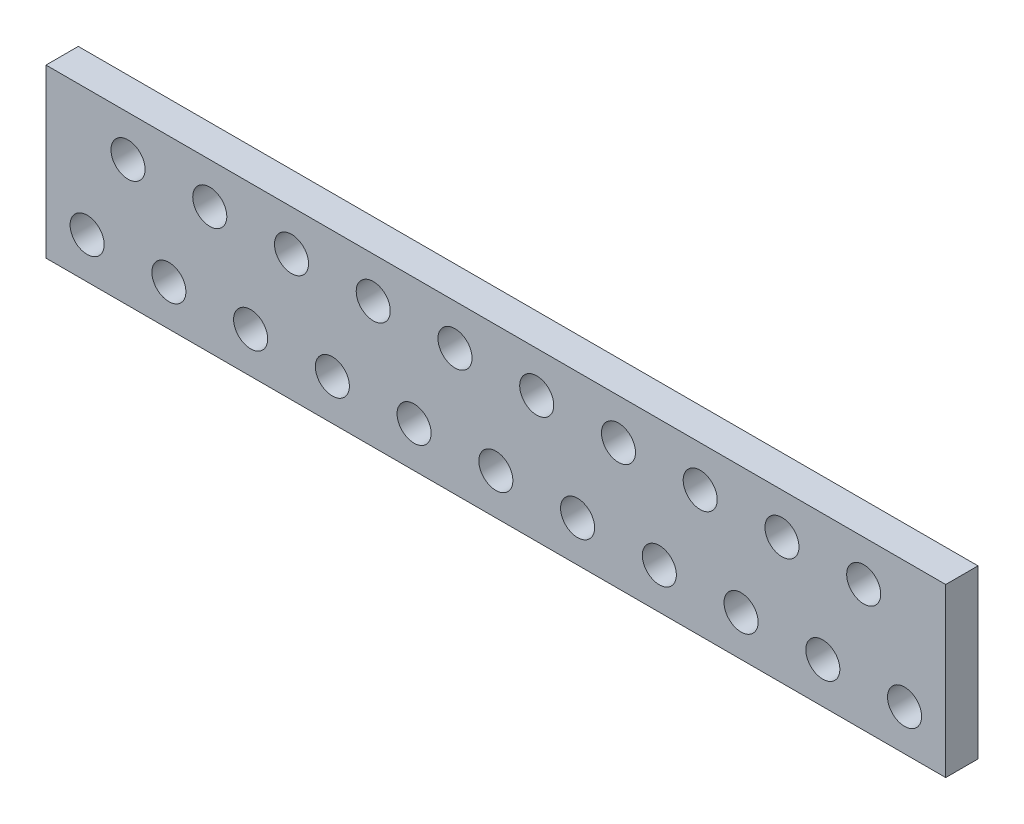
ISO-10303-21;
HEADER;
FILE_DESCRIPTION(('STEP AP214'),'2;1');
FILE_NAME('part.step','',(''),(''),'','','');
FILE_SCHEMA(('AUTOMOTIVE_DESIGN { 1 0 10303 214 1 1 1 1 }'));
ENDSEC;
DATA;
#1=APPLICATION_CONTEXT('core data for automotive mechanical design processes');
#2=APPLICATION_PROTOCOL_DEFINITION('international standard','automotive_design',2000,#1);
#3=PRODUCT_CONTEXT('',#1,'mechanical');
#4=PRODUCT('Part','Part','',(#3));
#5=PRODUCT_RELATED_PRODUCT_CATEGORY('part','',(#4));
#6=PRODUCT_DEFINITION_FORMATION('','',#4);
#7=PRODUCT_DEFINITION_CONTEXT('part definition',#1,'design');
#8=PRODUCT_DEFINITION('design','',#6,#7);
#9=PRODUCT_DEFINITION_SHAPE('','',#8);
#10=(LENGTH_UNIT() NAMED_UNIT(*) SI_UNIT(.MILLI.,.METRE.));
#11=(NAMED_UNIT(*) PLANE_ANGLE_UNIT() SI_UNIT($,.RADIAN.));
#12=(NAMED_UNIT(*) SI_UNIT($,.STERADIAN.) SOLID_ANGLE_UNIT());
#13=UNCERTAINTY_MEASURE_WITH_UNIT(LENGTH_MEASURE(1.E-05),#10,'distance_accuracy_value','');
#14=(GEOMETRIC_REPRESENTATION_CONTEXT(3) GLOBAL_UNCERTAINTY_ASSIGNED_CONTEXT((#13)) GLOBAL_UNIT_ASSIGNED_CONTEXT((#10,
#11,#12)) REPRESENTATION_CONTEXT('',''));
#15=CARTESIAN_POINT('',(0.,0.,0.));
#16=DIRECTION('',(0.,0.,1.));
#17=DIRECTION('',(1.,0.,0.));
#18=AXIS2_PLACEMENT_3D('',#15,#16,#17);
#19=CARTESIAN_POINT('',(-19.812,3.683,1.4224));
#20=DIRECTION('',(1.,0.,0.));
#21=DIRECTION('',(0.,0.,-1.));
#22=AXIS2_PLACEMENT_3D('',#19,#20,#21);
#23=PLANE('',#22);
#24=DIRECTION('',(0.,-1.,0.));
#25=VECTOR('',#24,1.);
#26=CARTESIAN_POINT('',(-19.812,3.683,0.));
#27=LINE('',#26,#25);
#28=CARTESIAN_POINT('',(-19.812,3.683,0.));
#29=VERTEX_POINT('',#28);
#30=CARTESIAN_POINT('',(-19.812,-3.683,0.));
#31=VERTEX_POINT('',#30);
#32=EDGE_CURVE('E95',#29,#31,#27,.T.);
#33=ORIENTED_EDGE('',*,*,#32,.T.);
#34=DIRECTION('',(0.,0.,-1.));
#35=VECTOR('',#34,1.);
#36=CARTESIAN_POINT('',(-19.812,-3.683,1.4224));
#37=LINE('',#36,#35);
#38=CARTESIAN_POINT('',(-19.812,-3.683,1.4224));
#39=VERTEX_POINT('',#38);
#40=EDGE_CURVE('E11',#39,#31,#37,.T.);
#41=ORIENTED_EDGE('',*,*,#40,.F.);
#42=DIRECTION('',(0.,-1.,0.));
#43=VECTOR('',#42,1.);
#44=CARTESIAN_POINT('',(-19.812,3.683,1.4224));
#45=LINE('',#44,#43);
#46=CARTESIAN_POINT('',(-19.812,3.683,1.4224));
#47=VERTEX_POINT('',#46);
#48=EDGE_CURVE('E81',#47,#39,#45,.T.);
#49=ORIENTED_EDGE('',*,*,#48,.F.);
#50=DIRECTION('',(0.,0.,-1.));
#51=VECTOR('',#50,1.);
#52=CARTESIAN_POINT('',(-19.812,3.683,1.4224));
#53=LINE('',#52,#51);
#54=EDGE_CURVE('E48',#47,#29,#53,.T.);
#55=ORIENTED_EDGE('',*,*,#54,.T.);
#56=EDGE_LOOP('',(#33,#41,#49,#55));
#57=FACE_BOUND('',#56,.T.);
#58=ADVANCED_FACE('F32',(#57),#23,.F.);
#59=CARTESIAN_POINT('',(-19.812,-3.683,1.4224));
#60=DIRECTION('',(0.,1.,0.));
#61=DIRECTION('',(0.,0.,1.));
#62=AXIS2_PLACEMENT_3D('',#59,#60,#61);
#63=PLANE('',#62);
#64=DIRECTION('',(1.,0.,0.));
#65=VECTOR('',#64,1.);
#66=CARTESIAN_POINT('',(-19.812,-3.683,0.));
#67=LINE('',#66,#65);
#68=CARTESIAN_POINT('',(19.812,-3.683,0.));
#69=VERTEX_POINT('',#68);
#70=EDGE_CURVE('E86',#31,#69,#67,.T.);
#71=ORIENTED_EDGE('',*,*,#70,.T.);
#72=DIRECTION('',(0.,0.,-1.));
#73=VECTOR('',#72,1.);
#74=CARTESIAN_POINT('',(19.812,-3.683,1.4224));
#75=LINE('',#74,#73);
#76=CARTESIAN_POINT('',(19.812,-3.683,1.4224));
#77=VERTEX_POINT('',#76);
#78=EDGE_CURVE('E40',#77,#69,#75,.T.);
#79=ORIENTED_EDGE('',*,*,#78,.F.);
#80=DIRECTION('',(1.,0.,0.));
#81=VECTOR('',#80,1.);
#82=CARTESIAN_POINT('',(-19.812,-3.683,1.4224));
#83=LINE('',#82,#81);
#84=EDGE_CURVE('E73',#39,#77,#83,.T.);
#85=ORIENTED_EDGE('',*,*,#84,.F.);
#86=ORIENTED_EDGE('',*,*,#40,.T.);
#87=EDGE_LOOP('',(#71,#79,#85,#86));
#88=FACE_BOUND('',#87,.T.);
#89=ADVANCED_FACE('F85',(#88),#63,.F.);
#90=CARTESIAN_POINT('',(19.812,3.683,1.4224));
#91=DIRECTION('',(1.,0.,0.));
#92=DIRECTION('',(0.,0.,-1.));
#93=AXIS2_PLACEMENT_3D('',#90,#91,#92);
#94=PLANE('',#93);
#95=DIRECTION('',(0.,-1.,0.));
#96=VECTOR('',#95,1.);
#97=CARTESIAN_POINT('',(19.812,3.683,0.));
#98=LINE('',#97,#96);
#99=CARTESIAN_POINT('',(19.812,3.683,0.));
#100=VERTEX_POINT('',#99);
#101=EDGE_CURVE('E99',#100,#69,#98,.T.);
#102=ORIENTED_EDGE('',*,*,#101,.F.);
#103=DIRECTION('',(0.,0.,-1.));
#104=VECTOR('',#103,1.);
#105=CARTESIAN_POINT('',(19.812,3.683,1.4224));
#106=LINE('',#105,#104);
#107=CARTESIAN_POINT('',(19.812,3.683,1.4224));
#108=VERTEX_POINT('',#107);
#109=EDGE_CURVE('E62',#108,#100,#106,.T.);
#110=ORIENTED_EDGE('',*,*,#109,.F.);
#111=DIRECTION('',(0.,-1.,0.));
#112=VECTOR('',#111,1.);
#113=CARTESIAN_POINT('',(19.812,3.683,1.4224));
#114=LINE('',#113,#112);
#115=EDGE_CURVE('E80',#108,#77,#114,.T.);
#116=ORIENTED_EDGE('',*,*,#115,.T.);
#117=ORIENTED_EDGE('',*,*,#78,.T.);
#118=EDGE_LOOP('',(#102,#110,#116,#117));
#119=FACE_BOUND('',#118,.T.);
#120=ADVANCED_FACE('F89',(#119),#94,.T.);
#121=CARTESIAN_POINT('',(-19.812,3.683,1.4224));
#122=DIRECTION('',(0.,1.,0.));
#123=DIRECTION('',(0.,0.,1.));
#124=AXIS2_PLACEMENT_3D('',#121,#122,#123);
#125=PLANE('',#124);
#126=DIRECTION('',(1.,0.,0.));
#127=VECTOR('',#126,1.);
#128=CARTESIAN_POINT('',(-19.812,3.683,0.));
#129=LINE('',#128,#127);
#130=EDGE_CURVE('E101',#29,#100,#129,.T.);
#131=ORIENTED_EDGE('',*,*,#130,.F.);
#132=ORIENTED_EDGE('',*,*,#54,.F.);
#133=DIRECTION('',(1.,0.,0.));
#134=VECTOR('',#133,1.);
#135=CARTESIAN_POINT('',(-19.812,3.683,1.4224));
#136=LINE('',#135,#134);
#137=EDGE_CURVE('E90',#47,#108,#136,.T.);
#138=ORIENTED_EDGE('',*,*,#137,.T.);
#139=ORIENTED_EDGE('',*,*,#109,.T.);
#140=EDGE_LOOP('',(#131,#132,#138,#139));
#141=FACE_BOUND('',#140,.T.);
#142=ADVANCED_FACE('F286',(#141),#125,.T.);
#143=CARTESIAN_POINT('',(0.,0.,1.4224));
#144=DIRECTION('',(0.,0.,1.));
#145=DIRECTION('',(1.,0.,0.));
#146=AXIS2_PLACEMENT_3D('',#143,#144,#145);
#147=PLANE('',#146);
#148=CARTESIAN_POINT('',(16.2,1.885,1.4224));
#149=DIRECTION('',(0.,0.,-1.));
#150=DIRECTION('',(-1.,0.,0.));
#151=AXIS2_PLACEMENT_3D('',#148,#149,#150);
#152=CIRCLE('',#151,0.75);
#153=CARTESIAN_POINT('',(15.45,1.885,1.4224));
#154=VERTEX_POINT('',#153);
#155=EDGE_CURVE('E224',#154,#154,#152,.T.);
#156=ORIENTED_EDGE('',*,*,#155,.T.);
#157=EDGE_LOOP('',(#156));
#158=FACE_BOUND('',#157,.T.);
#159=CARTESIAN_POINT('',(12.6,1.885,1.4224));
#160=DIRECTION('',(0.,0.,-1.));
#161=DIRECTION('',(-1.,0.,0.));
#162=AXIS2_PLACEMENT_3D('',#159,#160,#161);
#163=CIRCLE('',#162,0.75);
#164=CARTESIAN_POINT('',(11.85,1.885,1.4224));
#165=VERTEX_POINT('',#164);
#166=EDGE_CURVE('E218',#165,#165,#163,.T.);
#167=ORIENTED_EDGE('',*,*,#166,.T.);
#168=EDGE_LOOP('',(#167));
#169=FACE_BOUND('',#168,.T.);
#170=CARTESIAN_POINT('',(9.,1.885,1.4224));
#171=DIRECTION('',(0.,0.,-1.));
#172=DIRECTION('',(-1.,0.,0.));
#173=AXIS2_PLACEMENT_3D('',#170,#171,#172);
#174=CIRCLE('',#173,0.75);
#175=CARTESIAN_POINT('',(8.25,1.885,1.4224));
#176=VERTEX_POINT('',#175);
#177=EDGE_CURVE('E212',#176,#176,#174,.T.);
#178=ORIENTED_EDGE('',*,*,#177,.T.);
#179=EDGE_LOOP('',(#178));
#180=FACE_BOUND('',#179,.T.);
#181=CARTESIAN_POINT('',(5.4,1.885,1.4224));
#182=DIRECTION('',(0.,0.,-1.));
#183=DIRECTION('',(-1.,0.,0.));
#184=AXIS2_PLACEMENT_3D('',#181,#182,#183);
#185=CIRCLE('',#184,0.75);
#186=CARTESIAN_POINT('',(4.65,1.885,1.4224));
#187=VERTEX_POINT('',#186);
#188=EDGE_CURVE('E206',#187,#187,#185,.T.);
#189=ORIENTED_EDGE('',*,*,#188,.T.);
#190=EDGE_LOOP('',(#189));
#191=FACE_BOUND('',#190,.T.);
#192=CARTESIAN_POINT('',(1.8,1.885,1.4224));
#193=DIRECTION('',(0.,0.,-1.));
#194=DIRECTION('',(-1.,0.,0.));
#195=AXIS2_PLACEMENT_3D('',#192,#193,#194);
#196=CIRCLE('',#195,0.75);
#197=CARTESIAN_POINT('',(1.05,1.885,1.4224));
#198=VERTEX_POINT('',#197);
#199=EDGE_CURVE('E200',#198,#198,#196,.T.);
#200=ORIENTED_EDGE('',*,*,#199,.T.);
#201=EDGE_LOOP('',(#200));
#202=FACE_BOUND('',#201,.T.);
#203=CARTESIAN_POINT('',(-1.8,1.885,1.4224));
#204=DIRECTION('',(0.,0.,-1.));
#205=DIRECTION('',(-1.,0.,0.));
#206=AXIS2_PLACEMENT_3D('',#203,#204,#205);
#207=CIRCLE('',#206,0.75);
#208=CARTESIAN_POINT('',(-2.55,1.885,1.4224));
#209=VERTEX_POINT('',#208);
#210=EDGE_CURVE('E194',#209,#209,#207,.T.);
#211=ORIENTED_EDGE('',*,*,#210,.T.);
#212=EDGE_LOOP('',(#211));
#213=FACE_BOUND('',#212,.T.);
#214=CARTESIAN_POINT('',(-5.4,1.885,1.4224));
#215=DIRECTION('',(0.,0.,-1.));
#216=DIRECTION('',(-1.,0.,0.));
#217=AXIS2_PLACEMENT_3D('',#214,#215,#216);
#218=CIRCLE('',#217,0.75);
#219=CARTESIAN_POINT('',(-6.15,1.885,1.4224));
#220=VERTEX_POINT('',#219);
#221=EDGE_CURVE('E188',#220,#220,#218,.T.);
#222=ORIENTED_EDGE('',*,*,#221,.T.);
#223=EDGE_LOOP('',(#222));
#224=FACE_BOUND('',#223,.T.);
#225=CARTESIAN_POINT('',(-9.,1.885,1.4224));
#226=DIRECTION('',(0.,0.,-1.));
#227=DIRECTION('',(-1.,0.,0.));
#228=AXIS2_PLACEMENT_3D('',#225,#226,#227);
#229=CIRCLE('',#228,0.75);
#230=CARTESIAN_POINT('',(-9.75,1.885,1.4224));
#231=VERTEX_POINT('',#230);
#232=EDGE_CURVE('E182',#231,#231,#229,.T.);
#233=ORIENTED_EDGE('',*,*,#232,.T.);
#234=EDGE_LOOP('',(#233));
#235=FACE_BOUND('',#234,.T.);
#236=CARTESIAN_POINT('',(-12.6,1.885,1.4224));
#237=DIRECTION('',(0.,0.,-1.));
#238=DIRECTION('',(-1.,0.,0.));
#239=AXIS2_PLACEMENT_3D('',#236,#237,#238);
#240=CIRCLE('',#239,0.75);
#241=CARTESIAN_POINT('',(-13.35,1.885,1.4224));
#242=VERTEX_POINT('',#241);
#243=EDGE_CURVE('E176',#242,#242,#240,.T.);
#244=ORIENTED_EDGE('',*,*,#243,.T.);
#245=EDGE_LOOP('',(#244));
#246=FACE_BOUND('',#245,.T.);
#247=CARTESIAN_POINT('',(-16.2,1.885,1.4224));
#248=DIRECTION('',(0.,0.,-1.));
#249=DIRECTION('',(-1.,0.,0.));
#250=AXIS2_PLACEMENT_3D('',#247,#248,#249);
#251=CIRCLE('',#250,0.750000000000002);
#252=CARTESIAN_POINT('',(-16.95,1.885,1.4224));
#253=VERTEX_POINT('',#252);
#254=EDGE_CURVE('E170',#253,#253,#251,.T.);
#255=ORIENTED_EDGE('',*,*,#254,.T.);
#256=EDGE_LOOP('',(#255));
#257=FACE_BOUND('',#256,.T.);
#258=CARTESIAN_POINT('',(-18.,-1.885,1.4224));
#259=DIRECTION('',(0.,0.,-1.));
#260=DIRECTION('',(-1.,0.,0.));
#261=AXIS2_PLACEMENT_3D('',#258,#259,#260);
#262=CIRCLE('',#261,0.750000000000002);
#263=CARTESIAN_POINT('',(-18.75,-1.885,1.4224));
#264=VERTEX_POINT('',#263);
#265=EDGE_CURVE('E164',#264,#264,#262,.T.);
#266=ORIENTED_EDGE('',*,*,#265,.T.);
#267=EDGE_LOOP('',(#266));
#268=FACE_BOUND('',#267,.T.);
#269=CARTESIAN_POINT('',(-14.4,-1.885,1.4224));
#270=DIRECTION('',(0.,0.,-1.));
#271=DIRECTION('',(-1.,0.,0.));
#272=AXIS2_PLACEMENT_3D('',#269,#270,#271);
#273=CIRCLE('',#272,0.75);
#274=CARTESIAN_POINT('',(-15.15,-1.885,1.4224));
#275=VERTEX_POINT('',#274);
#276=EDGE_CURVE('E158',#275,#275,#273,.T.);
#277=ORIENTED_EDGE('',*,*,#276,.T.);
#278=EDGE_LOOP('',(#277));
#279=FACE_BOUND('',#278,.T.);
#280=CARTESIAN_POINT('',(-10.8,-1.885,1.4224));
#281=DIRECTION('',(0.,0.,-1.));
#282=DIRECTION('',(-1.,0.,0.));
#283=AXIS2_PLACEMENT_3D('',#280,#281,#282);
#284=CIRCLE('',#283,0.75);
#285=CARTESIAN_POINT('',(-11.55,-1.885,1.4224));
#286=VERTEX_POINT('',#285);
#287=EDGE_CURVE('E152',#286,#286,#284,.T.);
#288=ORIENTED_EDGE('',*,*,#287,.T.);
#289=EDGE_LOOP('',(#288));
#290=FACE_BOUND('',#289,.T.);
#291=CARTESIAN_POINT('',(-7.2,-1.885,1.4224));
#292=DIRECTION('',(0.,0.,-1.));
#293=DIRECTION('',(-1.,0.,0.));
#294=AXIS2_PLACEMENT_3D('',#291,#292,#293);
#295=CIRCLE('',#294,0.75);
#296=CARTESIAN_POINT('',(-7.95,-1.885,1.4224));
#297=VERTEX_POINT('',#296);
#298=EDGE_CURVE('E146',#297,#297,#295,.T.);
#299=ORIENTED_EDGE('',*,*,#298,.T.);
#300=EDGE_LOOP('',(#299));
#301=FACE_BOUND('',#300,.T.);
#302=CARTESIAN_POINT('',(-3.6,-1.885,1.4224));
#303=DIRECTION('',(0.,0.,-1.));
#304=DIRECTION('',(-1.,0.,0.));
#305=AXIS2_PLACEMENT_3D('',#302,#303,#304);
#306=CIRCLE('',#305,0.75);
#307=CARTESIAN_POINT('',(-4.35,-1.885,1.4224));
#308=VERTEX_POINT('',#307);
#309=EDGE_CURVE('E140',#308,#308,#306,.T.);
#310=ORIENTED_EDGE('',*,*,#309,.T.);
#311=EDGE_LOOP('',(#310));
#312=FACE_BOUND('',#311,.T.);
#313=CARTESIAN_POINT('',(0.,-1.885,1.4224));
#314=DIRECTION('',(0.,0.,-1.));
#315=DIRECTION('',(-1.,0.,0.));
#316=AXIS2_PLACEMENT_3D('',#313,#314,#315);
#317=CIRCLE('',#316,0.75);
#318=CARTESIAN_POINT('',(-0.75,-1.885,1.4224));
#319=VERTEX_POINT('',#318);
#320=EDGE_CURVE('E134',#319,#319,#317,.T.);
#321=ORIENTED_EDGE('',*,*,#320,.T.);
#322=EDGE_LOOP('',(#321));
#323=FACE_BOUND('',#322,.T.);
#324=CARTESIAN_POINT('',(3.6,-1.885,1.4224));
#325=DIRECTION('',(0.,0.,-1.));
#326=DIRECTION('',(-1.,0.,0.));
#327=AXIS2_PLACEMENT_3D('',#324,#325,#326);
#328=CIRCLE('',#327,0.75);
#329=CARTESIAN_POINT('',(2.85,-1.885,1.4224));
#330=VERTEX_POINT('',#329);
#331=EDGE_CURVE('E128',#330,#330,#328,.T.);
#332=ORIENTED_EDGE('',*,*,#331,.T.);
#333=EDGE_LOOP('',(#332));
#334=FACE_BOUND('',#333,.T.);
#335=CARTESIAN_POINT('',(7.2,-1.885,1.4224));
#336=DIRECTION('',(0.,0.,-1.));
#337=DIRECTION('',(-1.,0.,0.));
#338=AXIS2_PLACEMENT_3D('',#335,#336,#337);
#339=CIRCLE('',#338,0.75);
#340=CARTESIAN_POINT('',(6.45,-1.885,1.4224));
#341=VERTEX_POINT('',#340);
#342=EDGE_CURVE('E122',#341,#341,#339,.T.);
#343=ORIENTED_EDGE('',*,*,#342,.T.);
#344=EDGE_LOOP('',(#343));
#345=FACE_BOUND('',#344,.T.);
#346=CARTESIAN_POINT('',(10.8,-1.885,1.4224));
#347=DIRECTION('',(0.,0.,-1.));
#348=DIRECTION('',(-1.,0.,0.));
#349=AXIS2_PLACEMENT_3D('',#346,#347,#348);
#350=CIRCLE('',#349,0.75);
#351=CARTESIAN_POINT('',(10.05,-1.885,1.4224));
#352=VERTEX_POINT('',#351);
#353=EDGE_CURVE('E116',#352,#352,#350,.T.);
#354=ORIENTED_EDGE('',*,*,#353,.T.);
#355=EDGE_LOOP('',(#354));
#356=FACE_BOUND('',#355,.T.);
#357=CARTESIAN_POINT('',(14.4,-1.885,1.4224));
#358=DIRECTION('',(0.,0.,-1.));
#359=DIRECTION('',(-1.,0.,0.));
#360=AXIS2_PLACEMENT_3D('',#357,#358,#359);
#361=CIRCLE('',#360,0.75);
#362=CARTESIAN_POINT('',(13.65,-1.885,1.4224));
#363=VERTEX_POINT('',#362);
#364=EDGE_CURVE('E110',#363,#363,#361,.T.);
#365=ORIENTED_EDGE('',*,*,#364,.T.);
#366=EDGE_LOOP('',(#365));
#367=FACE_BOUND('',#366,.T.);
#368=CARTESIAN_POINT('',(18.,-1.885,1.4224));
#369=DIRECTION('',(0.,0.,-1.));
#370=DIRECTION('',(-1.,0.,0.));
#371=AXIS2_PLACEMENT_3D('',#368,#369,#370);
#372=CIRCLE('',#371,0.750000000000002);
#373=CARTESIAN_POINT('',(17.25,-1.885,1.4224));
#374=VERTEX_POINT('',#373);
#375=EDGE_CURVE('E97',#374,#374,#372,.T.);
#376=ORIENTED_EDGE('',*,*,#375,.T.);
#377=EDGE_LOOP('',(#376));
#378=FACE_BOUND('',#377,.T.);
#379=ORIENTED_EDGE('',*,*,#48,.T.);
#380=ORIENTED_EDGE('',*,*,#84,.T.);
#381=ORIENTED_EDGE('',*,*,#115,.F.);
#382=ORIENTED_EDGE('',*,*,#137,.F.);
#383=EDGE_LOOP('',(#379,#380,#381,#382));
#384=FACE_BOUND('',#383,.T.);
#385=ADVANCED_FACE('F77',(#158,#169,#180,#191,#202,#213,#224,#235,#246,#257,#268,#279,#290,#301,
#312,#323,#334,#345,#356,#367,#378,#384),#147,.T.);
#386=CARTESIAN_POINT('',(0.,0.,0.));
#387=DIRECTION('',(0.,0.,1.));
#388=DIRECTION('',(1.,0.,0.));
#389=AXIS2_PLACEMENT_3D('',#386,#387,#388);
#390=PLANE('',#389);
#391=CARTESIAN_POINT('',(16.2,1.885,0.));
#392=DIRECTION('',(0.,0.,-1.));
#393=DIRECTION('',(-1.,0.,0.));
#394=AXIS2_PLACEMENT_3D('',#391,#392,#393);
#395=CIRCLE('',#394,0.75);
#396=CARTESIAN_POINT('',(15.45,1.885,0.));
#397=VERTEX_POINT('',#396);
#398=EDGE_CURVE('E227',#397,#397,#395,.T.);
#399=ORIENTED_EDGE('',*,*,#398,.F.);
#400=EDGE_LOOP('',(#399));
#401=FACE_BOUND('',#400,.T.);
#402=CARTESIAN_POINT('',(12.6,1.885,0.));
#403=DIRECTION('',(0.,0.,-1.));
#404=DIRECTION('',(-1.,0.,0.));
#405=AXIS2_PLACEMENT_3D('',#402,#403,#404);
#406=CIRCLE('',#405,0.75);
#407=CARTESIAN_POINT('',(11.85,1.885,0.));
#408=VERTEX_POINT('',#407);
#409=EDGE_CURVE('E221',#408,#408,#406,.T.);
#410=ORIENTED_EDGE('',*,*,#409,.F.);
#411=EDGE_LOOP('',(#410));
#412=FACE_BOUND('',#411,.T.);
#413=CARTESIAN_POINT('',(9.,1.885,0.));
#414=DIRECTION('',(0.,0.,-1.));
#415=DIRECTION('',(-1.,0.,0.));
#416=AXIS2_PLACEMENT_3D('',#413,#414,#415);
#417=CIRCLE('',#416,0.75);
#418=CARTESIAN_POINT('',(8.25,1.885,0.));
#419=VERTEX_POINT('',#418);
#420=EDGE_CURVE('E215',#419,#419,#417,.T.);
#421=ORIENTED_EDGE('',*,*,#420,.F.);
#422=EDGE_LOOP('',(#421));
#423=FACE_BOUND('',#422,.T.);
#424=CARTESIAN_POINT('',(5.4,1.885,0.));
#425=DIRECTION('',(0.,0.,-1.));
#426=DIRECTION('',(-1.,0.,0.));
#427=AXIS2_PLACEMENT_3D('',#424,#425,#426);
#428=CIRCLE('',#427,0.75);
#429=CARTESIAN_POINT('',(4.65,1.885,0.));
#430=VERTEX_POINT('',#429);
#431=EDGE_CURVE('E209',#430,#430,#428,.T.);
#432=ORIENTED_EDGE('',*,*,#431,.F.);
#433=EDGE_LOOP('',(#432));
#434=FACE_BOUND('',#433,.T.);
#435=CARTESIAN_POINT('',(1.8,1.885,0.));
#436=DIRECTION('',(0.,0.,-1.));
#437=DIRECTION('',(-1.,0.,0.));
#438=AXIS2_PLACEMENT_3D('',#435,#436,#437);
#439=CIRCLE('',#438,0.75);
#440=CARTESIAN_POINT('',(1.05,1.885,0.));
#441=VERTEX_POINT('',#440);
#442=EDGE_CURVE('E203',#441,#441,#439,.T.);
#443=ORIENTED_EDGE('',*,*,#442,.F.);
#444=EDGE_LOOP('',(#443));
#445=FACE_BOUND('',#444,.T.);
#446=CARTESIAN_POINT('',(-1.8,1.885,0.));
#447=DIRECTION('',(0.,0.,-1.));
#448=DIRECTION('',(-1.,0.,0.));
#449=AXIS2_PLACEMENT_3D('',#446,#447,#448);
#450=CIRCLE('',#449,0.75);
#451=CARTESIAN_POINT('',(-2.55,1.885,0.));
#452=VERTEX_POINT('',#451);
#453=EDGE_CURVE('E197',#452,#452,#450,.T.);
#454=ORIENTED_EDGE('',*,*,#453,.F.);
#455=EDGE_LOOP('',(#454));
#456=FACE_BOUND('',#455,.T.);
#457=CARTESIAN_POINT('',(-5.4,1.885,0.));
#458=DIRECTION('',(0.,0.,-1.));
#459=DIRECTION('',(-1.,0.,0.));
#460=AXIS2_PLACEMENT_3D('',#457,#458,#459);
#461=CIRCLE('',#460,0.75);
#462=CARTESIAN_POINT('',(-6.15,1.885,0.));
#463=VERTEX_POINT('',#462);
#464=EDGE_CURVE('E191',#463,#463,#461,.T.);
#465=ORIENTED_EDGE('',*,*,#464,.F.);
#466=EDGE_LOOP('',(#465));
#467=FACE_BOUND('',#466,.T.);
#468=CARTESIAN_POINT('',(-9.,1.885,0.));
#469=DIRECTION('',(0.,0.,-1.));
#470=DIRECTION('',(-1.,0.,0.));
#471=AXIS2_PLACEMENT_3D('',#468,#469,#470);
#472=CIRCLE('',#471,0.75);
#473=CARTESIAN_POINT('',(-9.75,1.885,0.));
#474=VERTEX_POINT('',#473);
#475=EDGE_CURVE('E185',#474,#474,#472,.T.);
#476=ORIENTED_EDGE('',*,*,#475,.F.);
#477=EDGE_LOOP('',(#476));
#478=FACE_BOUND('',#477,.T.);
#479=CARTESIAN_POINT('',(-12.6,1.885,0.));
#480=DIRECTION('',(0.,0.,-1.));
#481=DIRECTION('',(-1.,0.,0.));
#482=AXIS2_PLACEMENT_3D('',#479,#480,#481);
#483=CIRCLE('',#482,0.75);
#484=CARTESIAN_POINT('',(-13.35,1.885,0.));
#485=VERTEX_POINT('',#484);
#486=EDGE_CURVE('E179',#485,#485,#483,.T.);
#487=ORIENTED_EDGE('',*,*,#486,.F.);
#488=EDGE_LOOP('',(#487));
#489=FACE_BOUND('',#488,.T.);
#490=CARTESIAN_POINT('',(-16.2,1.885,0.));
#491=DIRECTION('',(0.,0.,-1.));
#492=DIRECTION('',(-1.,0.,0.));
#493=AXIS2_PLACEMENT_3D('',#490,#491,#492);
#494=CIRCLE('',#493,0.750000000000002);
#495=CARTESIAN_POINT('',(-16.95,1.885,0.));
#496=VERTEX_POINT('',#495);
#497=EDGE_CURVE('E173',#496,#496,#494,.T.);
#498=ORIENTED_EDGE('',*,*,#497,.F.);
#499=EDGE_LOOP('',(#498));
#500=FACE_BOUND('',#499,.T.);
#501=CARTESIAN_POINT('',(-18.,-1.885,0.));
#502=DIRECTION('',(0.,0.,-1.));
#503=DIRECTION('',(-1.,0.,0.));
#504=AXIS2_PLACEMENT_3D('',#501,#502,#503);
#505=CIRCLE('',#504,0.750000000000002);
#506=CARTESIAN_POINT('',(-18.75,-1.885,0.));
#507=VERTEX_POINT('',#506);
#508=EDGE_CURVE('E167',#507,#507,#505,.T.);
#509=ORIENTED_EDGE('',*,*,#508,.F.);
#510=EDGE_LOOP('',(#509));
#511=FACE_BOUND('',#510,.T.);
#512=CARTESIAN_POINT('',(-14.4,-1.885,0.));
#513=DIRECTION('',(0.,0.,-1.));
#514=DIRECTION('',(-1.,0.,0.));
#515=AXIS2_PLACEMENT_3D('',#512,#513,#514);
#516=CIRCLE('',#515,0.75);
#517=CARTESIAN_POINT('',(-15.15,-1.885,0.));
#518=VERTEX_POINT('',#517);
#519=EDGE_CURVE('E161',#518,#518,#516,.T.);
#520=ORIENTED_EDGE('',*,*,#519,.F.);
#521=EDGE_LOOP('',(#520));
#522=FACE_BOUND('',#521,.T.);
#523=CARTESIAN_POINT('',(-10.8,-1.885,0.));
#524=DIRECTION('',(0.,0.,-1.));
#525=DIRECTION('',(-1.,0.,0.));
#526=AXIS2_PLACEMENT_3D('',#523,#524,#525);
#527=CIRCLE('',#526,0.75);
#528=CARTESIAN_POINT('',(-11.55,-1.885,0.));
#529=VERTEX_POINT('',#528);
#530=EDGE_CURVE('E155',#529,#529,#527,.T.);
#531=ORIENTED_EDGE('',*,*,#530,.F.);
#532=EDGE_LOOP('',(#531));
#533=FACE_BOUND('',#532,.T.);
#534=CARTESIAN_POINT('',(-7.2,-1.885,0.));
#535=DIRECTION('',(0.,0.,-1.));
#536=DIRECTION('',(-1.,0.,0.));
#537=AXIS2_PLACEMENT_3D('',#534,#535,#536);
#538=CIRCLE('',#537,0.75);
#539=CARTESIAN_POINT('',(-7.95,-1.885,0.));
#540=VERTEX_POINT('',#539);
#541=EDGE_CURVE('E149',#540,#540,#538,.T.);
#542=ORIENTED_EDGE('',*,*,#541,.F.);
#543=EDGE_LOOP('',(#542));
#544=FACE_BOUND('',#543,.T.);
#545=CARTESIAN_POINT('',(-3.6,-1.885,0.));
#546=DIRECTION('',(0.,0.,-1.));
#547=DIRECTION('',(-1.,0.,0.));
#548=AXIS2_PLACEMENT_3D('',#545,#546,#547);
#549=CIRCLE('',#548,0.75);
#550=CARTESIAN_POINT('',(-4.35,-1.885,0.));
#551=VERTEX_POINT('',#550);
#552=EDGE_CURVE('E143',#551,#551,#549,.T.);
#553=ORIENTED_EDGE('',*,*,#552,.F.);
#554=EDGE_LOOP('',(#553));
#555=FACE_BOUND('',#554,.T.);
#556=CARTESIAN_POINT('',(0.,-1.885,0.));
#557=DIRECTION('',(0.,0.,-1.));
#558=DIRECTION('',(-1.,0.,0.));
#559=AXIS2_PLACEMENT_3D('',#556,#557,#558);
#560=CIRCLE('',#559,0.75);
#561=CARTESIAN_POINT('',(-0.75,-1.885,0.));
#562=VERTEX_POINT('',#561);
#563=EDGE_CURVE('E137',#562,#562,#560,.T.);
#564=ORIENTED_EDGE('',*,*,#563,.F.);
#565=EDGE_LOOP('',(#564));
#566=FACE_BOUND('',#565,.T.);
#567=CARTESIAN_POINT('',(3.6,-1.885,0.));
#568=DIRECTION('',(0.,0.,-1.));
#569=DIRECTION('',(-1.,0.,0.));
#570=AXIS2_PLACEMENT_3D('',#567,#568,#569);
#571=CIRCLE('',#570,0.75);
#572=CARTESIAN_POINT('',(2.85,-1.885,0.));
#573=VERTEX_POINT('',#572);
#574=EDGE_CURVE('E131',#573,#573,#571,.T.);
#575=ORIENTED_EDGE('',*,*,#574,.F.);
#576=EDGE_LOOP('',(#575));
#577=FACE_BOUND('',#576,.T.);
#578=CARTESIAN_POINT('',(7.2,-1.885,0.));
#579=DIRECTION('',(0.,0.,-1.));
#580=DIRECTION('',(-1.,0.,0.));
#581=AXIS2_PLACEMENT_3D('',#578,#579,#580);
#582=CIRCLE('',#581,0.75);
#583=CARTESIAN_POINT('',(6.45,-1.885,0.));
#584=VERTEX_POINT('',#583);
#585=EDGE_CURVE('E125',#584,#584,#582,.T.);
#586=ORIENTED_EDGE('',*,*,#585,.F.);
#587=EDGE_LOOP('',(#586));
#588=FACE_BOUND('',#587,.T.);
#589=CARTESIAN_POINT('',(10.8,-1.885,0.));
#590=DIRECTION('',(0.,0.,-1.));
#591=DIRECTION('',(-1.,0.,0.));
#592=AXIS2_PLACEMENT_3D('',#589,#590,#591);
#593=CIRCLE('',#592,0.75);
#594=CARTESIAN_POINT('',(10.05,-1.885,0.));
#595=VERTEX_POINT('',#594);
#596=EDGE_CURVE('E119',#595,#595,#593,.T.);
#597=ORIENTED_EDGE('',*,*,#596,.F.);
#598=EDGE_LOOP('',(#597));
#599=FACE_BOUND('',#598,.T.);
#600=CARTESIAN_POINT('',(14.4,-1.885,0.));
#601=DIRECTION('',(0.,0.,-1.));
#602=DIRECTION('',(-1.,0.,0.));
#603=AXIS2_PLACEMENT_3D('',#600,#601,#602);
#604=CIRCLE('',#603,0.75);
#605=CARTESIAN_POINT('',(13.65,-1.885,0.));
#606=VERTEX_POINT('',#605);
#607=EDGE_CURVE('E113',#606,#606,#604,.T.);
#608=ORIENTED_EDGE('',*,*,#607,.F.);
#609=EDGE_LOOP('',(#608));
#610=FACE_BOUND('',#609,.T.);
#611=CARTESIAN_POINT('',(18.,-1.885,0.));
#612=DIRECTION('',(0.,0.,-1.));
#613=DIRECTION('',(-1.,0.,0.));
#614=AXIS2_PLACEMENT_3D('',#611,#612,#613);
#615=CIRCLE('',#614,0.750000000000002);
#616=CARTESIAN_POINT('',(17.25,-1.885,0.));
#617=VERTEX_POINT('',#616);
#618=EDGE_CURVE('E107',#617,#617,#615,.T.);
#619=ORIENTED_EDGE('',*,*,#618,.F.);
#620=EDGE_LOOP('',(#619));
#621=FACE_BOUND('',#620,.T.);
#622=ORIENTED_EDGE('',*,*,#32,.F.);
#623=ORIENTED_EDGE('',*,*,#130,.T.);
#624=ORIENTED_EDGE('',*,*,#101,.T.);
#625=ORIENTED_EDGE('',*,*,#70,.F.);
#626=EDGE_LOOP('',(#622,#623,#624,#625));
#627=FACE_BOUND('',#626,.T.);
#628=ADVANCED_FACE('F242',(#401,#412,#423,#434,#445,#456,#467,#478,#489,#500,#511,#522,#533,
#544,#555,#566,#577,#588,#599,#610,#621,#627),#390,.F.);
#629=CARTESIAN_POINT('',(18.,-1.885,1.4224));
#630=DIRECTION('',(0.,0.,-1.));
#631=DIRECTION('',(-1.,0.,0.));
#632=AXIS2_PLACEMENT_3D('',#629,#630,#631);
#633=CYLINDRICAL_SURFACE('',#632,0.750000000000002);
#634=ORIENTED_EDGE('',*,*,#375,.F.);
#635=EDGE_LOOP('',(#634));
#636=FACE_BOUND('',#635,.T.);
#637=ORIENTED_EDGE('',*,*,#618,.T.);
#638=EDGE_LOOP('',(#637));
#639=FACE_BOUND('',#638,.T.);
#640=ADVANCED_FACE('F245',(#636,#639),#633,.F.);
#641=CARTESIAN_POINT('',(14.4,-1.885,1.4224));
#642=DIRECTION('',(0.,0.,-1.));
#643=DIRECTION('',(-1.,0.,0.));
#644=AXIS2_PLACEMENT_3D('',#641,#642,#643);
#645=CYLINDRICAL_SURFACE('',#644,0.75);
#646=ORIENTED_EDGE('',*,*,#364,.F.);
#647=EDGE_LOOP('',(#646));
#648=FACE_BOUND('',#647,.T.);
#649=ORIENTED_EDGE('',*,*,#607,.T.);
#650=EDGE_LOOP('',(#649));
#651=FACE_BOUND('',#650,.T.);
#652=ADVANCED_FACE('F330',(#648,#651),#645,.F.);
#653=CARTESIAN_POINT('',(10.8,-1.885,1.4224));
#654=DIRECTION('',(0.,0.,-1.));
#655=DIRECTION('',(-1.,0.,0.));
#656=AXIS2_PLACEMENT_3D('',#653,#654,#655);
#657=CYLINDRICAL_SURFACE('',#656,0.75);
#658=ORIENTED_EDGE('',*,*,#353,.F.);
#659=EDGE_LOOP('',(#658));
#660=FACE_BOUND('',#659,.T.);
#661=ORIENTED_EDGE('',*,*,#596,.T.);
#662=EDGE_LOOP('',(#661));
#663=FACE_BOUND('',#662,.T.);
#664=ADVANCED_FACE('F340',(#660,#663),#657,.F.);
#665=CARTESIAN_POINT('',(7.2,-1.885,1.4224));
#666=DIRECTION('',(0.,0.,-1.));
#667=DIRECTION('',(-1.,0.,0.));
#668=AXIS2_PLACEMENT_3D('',#665,#666,#667);
#669=CYLINDRICAL_SURFACE('',#668,0.75);
#670=ORIENTED_EDGE('',*,*,#342,.F.);
#671=EDGE_LOOP('',(#670));
#672=FACE_BOUND('',#671,.T.);
#673=ORIENTED_EDGE('',*,*,#585,.T.);
#674=EDGE_LOOP('',(#673));
#675=FACE_BOUND('',#674,.T.);
#676=ADVANCED_FACE('F350',(#672,#675),#669,.F.);
#677=CARTESIAN_POINT('',(3.6,-1.885,1.4224));
#678=DIRECTION('',(0.,0.,-1.));
#679=DIRECTION('',(-1.,0.,0.));
#680=AXIS2_PLACEMENT_3D('',#677,#678,#679);
#681=CYLINDRICAL_SURFACE('',#680,0.75);
#682=ORIENTED_EDGE('',*,*,#331,.F.);
#683=EDGE_LOOP('',(#682));
#684=FACE_BOUND('',#683,.T.);
#685=ORIENTED_EDGE('',*,*,#574,.T.);
#686=EDGE_LOOP('',(#685));
#687=FACE_BOUND('',#686,.T.);
#688=ADVANCED_FACE('F360',(#684,#687),#681,.F.);
#689=CARTESIAN_POINT('',(0.,-1.885,1.4224));
#690=DIRECTION('',(0.,0.,-1.));
#691=DIRECTION('',(-1.,0.,0.));
#692=AXIS2_PLACEMENT_3D('',#689,#690,#691);
#693=CYLINDRICAL_SURFACE('',#692,0.75);
#694=ORIENTED_EDGE('',*,*,#320,.F.);
#695=EDGE_LOOP('',(#694));
#696=FACE_BOUND('',#695,.T.);
#697=ORIENTED_EDGE('',*,*,#563,.T.);
#698=EDGE_LOOP('',(#697));
#699=FACE_BOUND('',#698,.T.);
#700=ADVANCED_FACE('F370',(#696,#699),#693,.F.);
#701=CARTESIAN_POINT('',(-3.6,-1.885,1.4224));
#702=DIRECTION('',(0.,0.,-1.));
#703=DIRECTION('',(-1.,0.,0.));
#704=AXIS2_PLACEMENT_3D('',#701,#702,#703);
#705=CYLINDRICAL_SURFACE('',#704,0.75);
#706=ORIENTED_EDGE('',*,*,#309,.F.);
#707=EDGE_LOOP('',(#706));
#708=FACE_BOUND('',#707,.T.);
#709=ORIENTED_EDGE('',*,*,#552,.T.);
#710=EDGE_LOOP('',(#709));
#711=FACE_BOUND('',#710,.T.);
#712=ADVANCED_FACE('F380',(#708,#711),#705,.F.);
#713=CARTESIAN_POINT('',(-7.2,-1.885,1.4224));
#714=DIRECTION('',(0.,0.,-1.));
#715=DIRECTION('',(-1.,0.,0.));
#716=AXIS2_PLACEMENT_3D('',#713,#714,#715);
#717=CYLINDRICAL_SURFACE('',#716,0.75);
#718=ORIENTED_EDGE('',*,*,#298,.F.);
#719=EDGE_LOOP('',(#718));
#720=FACE_BOUND('',#719,.T.);
#721=ORIENTED_EDGE('',*,*,#541,.T.);
#722=EDGE_LOOP('',(#721));
#723=FACE_BOUND('',#722,.T.);
#724=ADVANCED_FACE('F390',(#720,#723),#717,.F.);
#725=CARTESIAN_POINT('',(-10.8,-1.885,1.4224));
#726=DIRECTION('',(0.,0.,-1.));
#727=DIRECTION('',(-1.,0.,0.));
#728=AXIS2_PLACEMENT_3D('',#725,#726,#727);
#729=CYLINDRICAL_SURFACE('',#728,0.75);
#730=ORIENTED_EDGE('',*,*,#287,.F.);
#731=EDGE_LOOP('',(#730));
#732=FACE_BOUND('',#731,.T.);
#733=ORIENTED_EDGE('',*,*,#530,.T.);
#734=EDGE_LOOP('',(#733));
#735=FACE_BOUND('',#734,.T.);
#736=ADVANCED_FACE('F400',(#732,#735),#729,.F.);
#737=CARTESIAN_POINT('',(-14.4,-1.885,1.4224));
#738=DIRECTION('',(0.,0.,-1.));
#739=DIRECTION('',(-1.,0.,0.));
#740=AXIS2_PLACEMENT_3D('',#737,#738,#739);
#741=CYLINDRICAL_SURFACE('',#740,0.75);
#742=ORIENTED_EDGE('',*,*,#276,.F.);
#743=EDGE_LOOP('',(#742));
#744=FACE_BOUND('',#743,.T.);
#745=ORIENTED_EDGE('',*,*,#519,.T.);
#746=EDGE_LOOP('',(#745));
#747=FACE_BOUND('',#746,.T.);
#748=ADVANCED_FACE('F410',(#744,#747),#741,.F.);
#749=CARTESIAN_POINT('',(-18.,-1.885,1.4224));
#750=DIRECTION('',(0.,0.,-1.));
#751=DIRECTION('',(-1.,0.,0.));
#752=AXIS2_PLACEMENT_3D('',#749,#750,#751);
#753=CYLINDRICAL_SURFACE('',#752,0.750000000000002);
#754=ORIENTED_EDGE('',*,*,#265,.F.);
#755=EDGE_LOOP('',(#754));
#756=FACE_BOUND('',#755,.T.);
#757=ORIENTED_EDGE('',*,*,#508,.T.);
#758=EDGE_LOOP('',(#757));
#759=FACE_BOUND('',#758,.T.);
#760=ADVANCED_FACE('F420',(#756,#759),#753,.F.);
#761=CARTESIAN_POINT('',(-16.2,1.885,1.4224));
#762=DIRECTION('',(0.,0.,-1.));
#763=DIRECTION('',(-1.,0.,0.));
#764=AXIS2_PLACEMENT_3D('',#761,#762,#763);
#765=CYLINDRICAL_SURFACE('',#764,0.750000000000002);
#766=ORIENTED_EDGE('',*,*,#254,.F.);
#767=EDGE_LOOP('',(#766));
#768=FACE_BOUND('',#767,.T.);
#769=ORIENTED_EDGE('',*,*,#497,.T.);
#770=EDGE_LOOP('',(#769));
#771=FACE_BOUND('',#770,.T.);
#772=ADVANCED_FACE('F430',(#768,#771),#765,.F.);
#773=CARTESIAN_POINT('',(-12.6,1.885,1.4224));
#774=DIRECTION('',(0.,0.,-1.));
#775=DIRECTION('',(-1.,0.,0.));
#776=AXIS2_PLACEMENT_3D('',#773,#774,#775);
#777=CYLINDRICAL_SURFACE('',#776,0.75);
#778=ORIENTED_EDGE('',*,*,#243,.F.);
#779=EDGE_LOOP('',(#778));
#780=FACE_BOUND('',#779,.T.);
#781=ORIENTED_EDGE('',*,*,#486,.T.);
#782=EDGE_LOOP('',(#781));
#783=FACE_BOUND('',#782,.T.);
#784=ADVANCED_FACE('F440',(#780,#783),#777,.F.);
#785=CARTESIAN_POINT('',(-9.,1.885,1.4224));
#786=DIRECTION('',(0.,0.,-1.));
#787=DIRECTION('',(-1.,0.,0.));
#788=AXIS2_PLACEMENT_3D('',#785,#786,#787);
#789=CYLINDRICAL_SURFACE('',#788,0.75);
#790=ORIENTED_EDGE('',*,*,#232,.F.);
#791=EDGE_LOOP('',(#790));
#792=FACE_BOUND('',#791,.T.);
#793=ORIENTED_EDGE('',*,*,#475,.T.);
#794=EDGE_LOOP('',(#793));
#795=FACE_BOUND('',#794,.T.);
#796=ADVANCED_FACE('F450',(#792,#795),#789,.F.);
#797=CARTESIAN_POINT('',(-5.4,1.885,1.4224));
#798=DIRECTION('',(0.,0.,-1.));
#799=DIRECTION('',(-1.,0.,0.));
#800=AXIS2_PLACEMENT_3D('',#797,#798,#799);
#801=CYLINDRICAL_SURFACE('',#800,0.75);
#802=ORIENTED_EDGE('',*,*,#221,.F.);
#803=EDGE_LOOP('',(#802));
#804=FACE_BOUND('',#803,.T.);
#805=ORIENTED_EDGE('',*,*,#464,.T.);
#806=EDGE_LOOP('',(#805));
#807=FACE_BOUND('',#806,.T.);
#808=ADVANCED_FACE('F460',(#804,#807),#801,.F.);
#809=CARTESIAN_POINT('',(-1.8,1.885,1.4224));
#810=DIRECTION('',(0.,0.,-1.));
#811=DIRECTION('',(-1.,0.,0.));
#812=AXIS2_PLACEMENT_3D('',#809,#810,#811);
#813=CYLINDRICAL_SURFACE('',#812,0.75);
#814=ORIENTED_EDGE('',*,*,#210,.F.);
#815=EDGE_LOOP('',(#814));
#816=FACE_BOUND('',#815,.T.);
#817=ORIENTED_EDGE('',*,*,#453,.T.);
#818=EDGE_LOOP('',(#817));
#819=FACE_BOUND('',#818,.T.);
#820=ADVANCED_FACE('F470',(#816,#819),#813,.F.);
#821=CARTESIAN_POINT('',(1.8,1.885,1.4224));
#822=DIRECTION('',(0.,0.,-1.));
#823=DIRECTION('',(-1.,0.,0.));
#824=AXIS2_PLACEMENT_3D('',#821,#822,#823);
#825=CYLINDRICAL_SURFACE('',#824,0.75);
#826=ORIENTED_EDGE('',*,*,#199,.F.);
#827=EDGE_LOOP('',(#826));
#828=FACE_BOUND('',#827,.T.);
#829=ORIENTED_EDGE('',*,*,#442,.T.);
#830=EDGE_LOOP('',(#829));
#831=FACE_BOUND('',#830,.T.);
#832=ADVANCED_FACE('F480',(#828,#831),#825,.F.);
#833=CARTESIAN_POINT('',(5.4,1.885,1.4224));
#834=DIRECTION('',(0.,0.,-1.));
#835=DIRECTION('',(-1.,0.,0.));
#836=AXIS2_PLACEMENT_3D('',#833,#834,#835);
#837=CYLINDRICAL_SURFACE('',#836,0.75);
#838=ORIENTED_EDGE('',*,*,#188,.F.);
#839=EDGE_LOOP('',(#838));
#840=FACE_BOUND('',#839,.T.);
#841=ORIENTED_EDGE('',*,*,#431,.T.);
#842=EDGE_LOOP('',(#841));
#843=FACE_BOUND('',#842,.T.);
#844=ADVANCED_FACE('F490',(#840,#843),#837,.F.);
#845=CARTESIAN_POINT('',(9.,1.885,1.4224));
#846=DIRECTION('',(0.,0.,-1.));
#847=DIRECTION('',(-1.,0.,0.));
#848=AXIS2_PLACEMENT_3D('',#845,#846,#847);
#849=CYLINDRICAL_SURFACE('',#848,0.75);
#850=ORIENTED_EDGE('',*,*,#177,.F.);
#851=EDGE_LOOP('',(#850));
#852=FACE_BOUND('',#851,.T.);
#853=ORIENTED_EDGE('',*,*,#420,.T.);
#854=EDGE_LOOP('',(#853));
#855=FACE_BOUND('',#854,.T.);
#856=ADVANCED_FACE('F500',(#852,#855),#849,.F.);
#857=CARTESIAN_POINT('',(12.6,1.885,1.4224));
#858=DIRECTION('',(0.,0.,-1.));
#859=DIRECTION('',(-1.,0.,0.));
#860=AXIS2_PLACEMENT_3D('',#857,#858,#859);
#861=CYLINDRICAL_SURFACE('',#860,0.75);
#862=ORIENTED_EDGE('',*,*,#166,.F.);
#863=EDGE_LOOP('',(#862));
#864=FACE_BOUND('',#863,.T.);
#865=ORIENTED_EDGE('',*,*,#409,.T.);
#866=EDGE_LOOP('',(#865));
#867=FACE_BOUND('',#866,.T.);
#868=ADVANCED_FACE('F238',(#864,#867),#861,.F.);
#869=CARTESIAN_POINT('',(16.2,1.885,1.4224));
#870=DIRECTION('',(0.,0.,-1.));
#871=DIRECTION('',(-1.,0.,0.));
#872=AXIS2_PLACEMENT_3D('',#869,#870,#871);
#873=CYLINDRICAL_SURFACE('',#872,0.75);
#874=ORIENTED_EDGE('',*,*,#155,.F.);
#875=EDGE_LOOP('',(#874));
#876=FACE_BOUND('',#875,.T.);
#877=ORIENTED_EDGE('',*,*,#398,.T.);
#878=EDGE_LOOP('',(#877));
#879=FACE_BOUND('',#878,.T.);
#880=ADVANCED_FACE('F235',(#876,#879),#873,.F.);
#881=CLOSED_SHELL('',(#58,#89,#120,#142,#385,#628,#640,#652,#664,#676,#688,#700,#712,#724,#736,
#748,#760,#772,#784,#796,#808,#820,#832,#844,#856,#868,#880));
#882=MANIFOLD_SOLID_BREP('B2',#881);
#883=ADVANCED_BREP_SHAPE_REPRESENTATION('',(#18,#882),#14);
#884=SHAPE_DEFINITION_REPRESENTATION(#9,#883);
ENDSEC;
END-ISO-10303-21;
